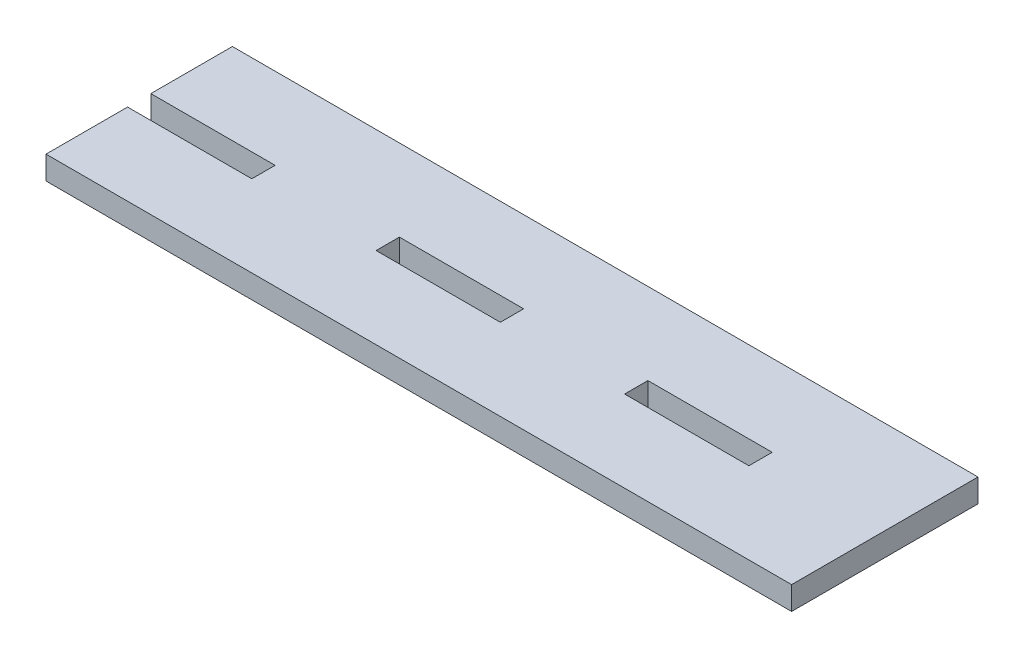
ISO-10303-21;
HEADER;
FILE_DESCRIPTION(('STEP AP214'),'2;1');
FILE_NAME('part.step','',(''),(''),'','','');
FILE_SCHEMA(('AUTOMOTIVE_DESIGN { 1 0 10303 214 1 1 1 1 }'));
ENDSEC;
DATA;
#1=APPLICATION_CONTEXT('core data for automotive mechanical design processes');
#2=APPLICATION_PROTOCOL_DEFINITION('international standard','automotive_design',2000,#1);
#3=PRODUCT_CONTEXT('',#1,'mechanical');
#4=PRODUCT('Part','Part','',(#3));
#5=PRODUCT_RELATED_PRODUCT_CATEGORY('part','',(#4));
#6=PRODUCT_DEFINITION_FORMATION('','',#4);
#7=PRODUCT_DEFINITION_CONTEXT('part definition',#1,'design');
#8=PRODUCT_DEFINITION('design','',#6,#7);
#9=PRODUCT_DEFINITION_SHAPE('','',#8);
#10=(LENGTH_UNIT() NAMED_UNIT(*) SI_UNIT(.MILLI.,.METRE.));
#11=(NAMED_UNIT(*) PLANE_ANGLE_UNIT() SI_UNIT($,.RADIAN.));
#12=(NAMED_UNIT(*) SI_UNIT($,.STERADIAN.) SOLID_ANGLE_UNIT());
#13=UNCERTAINTY_MEASURE_WITH_UNIT(LENGTH_MEASURE(1.E-05),#10,'distance_accuracy_value','');
#14=(GEOMETRIC_REPRESENTATION_CONTEXT(3) GLOBAL_UNCERTAINTY_ASSIGNED_CONTEXT((#13)) GLOBAL_UNIT_ASSIGNED_CONTEXT((#10,
#11,#12)) REPRESENTATION_CONTEXT('',''));
#15=CARTESIAN_POINT('',(0.,0.,0.));
#16=DIRECTION('',(0.,0.,1.));
#17=DIRECTION('',(1.,0.,0.));
#18=AXIS2_PLACEMENT_3D('',#15,#16,#17);
#19=CARTESIAN_POINT('',(25.4,4.7625,0.));
#20=DIRECTION('',(-1.,0.,0.));
#21=DIRECTION('',(0.,0.,1.));
#22=AXIS2_PLACEMENT_3D('',#19,#20,#21);
#23=PLANE('',#22);
#24=DIRECTION('',(0.,0.,-1.));
#25=VECTOR('',#24,1.);
#26=CARTESIAN_POINT('',(25.4,0.,0.));
#27=LINE('',#26,#25);
#28=CARTESIAN_POINT('',(25.4,0.,2.38125));
#29=VERTEX_POINT('',#28);
#30=CARTESIAN_POINT('',(25.4,0.,-2.38125));
#31=VERTEX_POINT('',#30);
#32=EDGE_CURVE('E218',#29,#31,#27,.T.);
#33=ORIENTED_EDGE('',*,*,#32,.T.);
#34=DIRECTION('',(0.,-1.,0.));
#35=VECTOR('',#34,1.);
#36=CARTESIAN_POINT('',(25.4,4.7625,-2.38125));
#37=LINE('',#36,#35);
#38=CARTESIAN_POINT('',(25.4,4.7625,-2.38125));
#39=VERTEX_POINT('',#38);
#40=EDGE_CURVE('E11',#39,#31,#37,.T.);
#41=ORIENTED_EDGE('',*,*,#40,.F.);
#42=DIRECTION('',(0.,0.,-1.));
#43=VECTOR('',#42,1.);
#44=CARTESIAN_POINT('',(25.4,4.7625,0.));
#45=LINE('',#44,#43);
#46=CARTESIAN_POINT('',(25.4,4.7625,2.38125));
#47=VERTEX_POINT('',#46);
#48=EDGE_CURVE('E168',#47,#39,#45,.T.);
#49=ORIENTED_EDGE('',*,*,#48,.F.);
#50=DIRECTION('',(0.,-1.,0.));
#51=VECTOR('',#50,1.);
#52=CARTESIAN_POINT('',(25.4,4.7625,2.38125));
#53=LINE('',#52,#51);
#54=EDGE_CURVE('E60',#47,#29,#53,.T.);
#55=ORIENTED_EDGE('',*,*,#54,.T.);
#56=EDGE_LOOP('',(#33,#41,#49,#55));
#57=FACE_BOUND('',#56,.T.);
#58=ADVANCED_FACE('F41',(#57),#23,.F.);
#59=CARTESIAN_POINT('',(0.,4.7625,-2.38124999999999));
#60=DIRECTION('',(0.,0.,-1.));
#61=DIRECTION('',(-1.,0.,0.));
#62=AXIS2_PLACEMENT_3D('',#59,#60,#61);
#63=PLANE('',#62);
#64=DIRECTION('',(1.,0.,0.));
#65=VECTOR('',#64,1.);
#66=CARTESIAN_POINT('',(0.,0.,-2.38124999999999));
#67=LINE('',#66,#65);
#68=CARTESIAN_POINT('',(50.8,0.,-2.38125000000001));
#69=VERTEX_POINT('',#68);
#70=EDGE_CURVE('E174',#31,#69,#67,.T.);
#71=ORIENTED_EDGE('',*,*,#70,.T.);
#72=DIRECTION('',(0.,-1.,0.));
#73=VECTOR('',#72,1.);
#74=CARTESIAN_POINT('',(50.8,4.7625,-2.38125000000001));
#75=LINE('',#74,#73);
#76=CARTESIAN_POINT('',(50.8,4.7625,-2.38125000000001));
#77=VERTEX_POINT('',#76);
#78=EDGE_CURVE('E51',#77,#69,#75,.T.);
#79=ORIENTED_EDGE('',*,*,#78,.F.);
#80=DIRECTION('',(1.,0.,0.));
#81=VECTOR('',#80,1.);
#82=CARTESIAN_POINT('',(0.,4.7625,-2.38124999999999));
#83=LINE('',#82,#81);
#84=EDGE_CURVE('E162',#39,#77,#83,.T.);
#85=ORIENTED_EDGE('',*,*,#84,.F.);
#86=ORIENTED_EDGE('',*,*,#40,.T.);
#87=EDGE_LOOP('',(#71,#79,#85,#86));
#88=FACE_BOUND('',#87,.T.);
#89=ADVANCED_FACE('F173',(#88),#63,.F.);
#90=CARTESIAN_POINT('',(50.8,4.7625,0.));
#91=DIRECTION('',(-1.,0.,0.));
#92=DIRECTION('',(0.,0.,1.));
#93=AXIS2_PLACEMENT_3D('',#90,#91,#92);
#94=PLANE('',#93);
#95=DIRECTION('',(0.,0.,-1.));
#96=VECTOR('',#95,1.);
#97=CARTESIAN_POINT('',(50.8,0.,0.));
#98=LINE('',#97,#96);
#99=CARTESIAN_POINT('',(50.8,0.,2.38125));
#100=VERTEX_POINT('',#99);
#101=EDGE_CURVE('E221',#100,#69,#98,.T.);
#102=ORIENTED_EDGE('',*,*,#101,.F.);
#103=DIRECTION('',(0.,-1.,0.));
#104=VECTOR('',#103,1.);
#105=CARTESIAN_POINT('',(50.8,4.7625,2.38125));
#106=LINE('',#105,#104);
#107=CARTESIAN_POINT('',(50.8,4.7625,2.38125));
#108=VERTEX_POINT('',#107);
#109=EDGE_CURVE('E110',#108,#100,#106,.T.);
#110=ORIENTED_EDGE('',*,*,#109,.F.);
#111=DIRECTION('',(0.,0.,-1.));
#112=VECTOR('',#111,1.);
#113=CARTESIAN_POINT('',(50.8,4.7625,0.));
#114=LINE('',#113,#112);
#115=EDGE_CURVE('E167',#108,#77,#114,.T.);
#116=ORIENTED_EDGE('',*,*,#115,.T.);
#117=ORIENTED_EDGE('',*,*,#78,.T.);
#118=EDGE_LOOP('',(#102,#110,#116,#117));
#119=FACE_BOUND('',#118,.T.);
#120=ADVANCED_FACE('F178',(#119),#94,.T.);
#121=CARTESIAN_POINT('',(-25.3999999999999,4.7625,0.));
#122=DIRECTION('',(-1.,0.,0.));
#123=DIRECTION('',(0.,0.,1.));
#124=AXIS2_PLACEMENT_3D('',#121,#122,#123);
#125=PLANE('',#124);
#126=DIRECTION('',(0.,0.,-1.));
#127=VECTOR('',#126,1.);
#128=CARTESIAN_POINT('',(-25.3999999999999,0.,0.));
#129=LINE('',#128,#127);
#130=CARTESIAN_POINT('',(-25.3999999999999,0.,2.38125));
#131=VERTEX_POINT('',#130);
#132=CARTESIAN_POINT('',(-25.3999999999999,0.,-2.38125));
#133=VERTEX_POINT('',#132);
#134=EDGE_CURVE('E206',#131,#133,#129,.T.);
#135=ORIENTED_EDGE('',*,*,#134,.T.);
#136=DIRECTION('',(0.,-1.,0.));
#137=VECTOR('',#136,1.);
#138=CARTESIAN_POINT('',(-25.3999999999999,4.7625,-2.38125));
#139=LINE('',#138,#137);
#140=CARTESIAN_POINT('',(-25.3999999999999,4.7625,-2.38125));
#141=VERTEX_POINT('',#140);
#142=EDGE_CURVE('E228',#141,#133,#139,.T.);
#143=ORIENTED_EDGE('',*,*,#142,.F.);
#144=DIRECTION('',(0.,0.,-1.));
#145=VECTOR('',#144,1.);
#146=CARTESIAN_POINT('',(-25.3999999999999,4.7625,0.));
#147=LINE('',#146,#145);
#148=CARTESIAN_POINT('',(-25.3999999999999,4.7625,2.38125));
#149=VERTEX_POINT('',#148);
#150=EDGE_CURVE('E287',#149,#141,#147,.T.);
#151=ORIENTED_EDGE('',*,*,#150,.F.);
#152=DIRECTION('',(0.,-1.,0.));
#153=VECTOR('',#152,1.);
#154=CARTESIAN_POINT('',(-25.3999999999999,4.7625,2.38125));
#155=LINE('',#154,#153);
#156=EDGE_CURVE('E230',#149,#131,#155,.T.);
#157=ORIENTED_EDGE('',*,*,#156,.T.);
#158=EDGE_LOOP('',(#135,#143,#151,#157));
#159=FACE_BOUND('',#158,.T.);
#160=ADVANCED_FACE('F318',(#159),#125,.F.);
#161=CARTESIAN_POINT('',(0.,4.7625,-2.38125000000001));
#162=DIRECTION('',(0.,0.,-1.));
#163=DIRECTION('',(-1.,0.,0.));
#164=AXIS2_PLACEMENT_3D('',#161,#162,#163);
#165=PLANE('',#164);
#166=DIRECTION('',(1.,0.,0.));
#167=VECTOR('',#166,1.);
#168=CARTESIAN_POINT('',(0.,0.,-2.38125000000001));
#169=LINE('',#168,#167);
#170=CARTESIAN_POINT('',(0.,0.,-2.38125000000001));
#171=VERTEX_POINT('',#170);
#172=EDGE_CURVE('E209',#133,#171,#169,.T.);
#173=ORIENTED_EDGE('',*,*,#172,.T.);
#174=DIRECTION('',(0.,-1.,0.));
#175=VECTOR('',#174,1.);
#176=CARTESIAN_POINT('',(0.,4.7625,-2.38125000000001));
#177=LINE('',#176,#175);
#178=CARTESIAN_POINT('',(0.,4.7625,-2.38125000000001));
#179=VERTEX_POINT('',#178);
#180=EDGE_CURVE('E234',#179,#171,#177,.T.);
#181=ORIENTED_EDGE('',*,*,#180,.F.);
#182=DIRECTION('',(1.,0.,0.));
#183=VECTOR('',#182,1.);
#184=CARTESIAN_POINT('',(0.,4.7625,-2.38125000000001));
#185=LINE('',#184,#183);
#186=EDGE_CURVE('E297',#141,#179,#185,.T.);
#187=ORIENTED_EDGE('',*,*,#186,.F.);
#188=ORIENTED_EDGE('',*,*,#142,.T.);
#189=EDGE_LOOP('',(#173,#181,#187,#188));
#190=FACE_BOUND('',#189,.T.);
#191=ADVANCED_FACE('F320',(#190),#165,.F.);
#192=CARTESIAN_POINT('',(0.,4.7625,0.));
#193=DIRECTION('',(-1.,0.,0.));
#194=DIRECTION('',(0.,0.,1.));
#195=AXIS2_PLACEMENT_3D('',#192,#193,#194);
#196=PLANE('',#195);
#197=DIRECTION('',(0.,0.,-1.));
#198=VECTOR('',#197,1.);
#199=CARTESIAN_POINT('',(0.,0.,0.));
#200=LINE('',#199,#198);
#201=CARTESIAN_POINT('',(0.,0.,2.38125));
#202=VERTEX_POINT('',#201);
#203=EDGE_CURVE('E212',#202,#171,#200,.T.);
#204=ORIENTED_EDGE('',*,*,#203,.F.);
#205=DIRECTION('',(0.,-1.,0.));
#206=VECTOR('',#205,1.);
#207=CARTESIAN_POINT('',(0.,4.7625,2.38125));
#208=LINE('',#207,#206);
#209=CARTESIAN_POINT('',(0.,4.7625,2.38125));
#210=VERTEX_POINT('',#209);
#211=EDGE_CURVE('E232',#210,#202,#208,.T.);
#212=ORIENTED_EDGE('',*,*,#211,.F.);
#213=DIRECTION('',(0.,0.,-1.));
#214=VECTOR('',#213,1.);
#215=CARTESIAN_POINT('',(0.,4.7625,0.));
#216=LINE('',#215,#214);
#217=EDGE_CURVE('E299',#210,#179,#216,.T.);
#218=ORIENTED_EDGE('',*,*,#217,.T.);
#219=ORIENTED_EDGE('',*,*,#180,.T.);
#220=EDGE_LOOP('',(#204,#212,#218,#219));
#221=FACE_BOUND('',#220,.T.);
#222=ADVANCED_FACE('F314',(#221),#196,.T.);
#223=CARTESIAN_POINT('',(-50.7999999999999,4.7625,0.));
#224=DIRECTION('',(-1.,0.,0.));
#225=DIRECTION('',(0.,0.,1.));
#226=AXIS2_PLACEMENT_3D('',#223,#224,#225);
#227=PLANE('',#226);
#228=DIRECTION('',(0.,0.,-1.));
#229=VECTOR('',#228,1.);
#230=CARTESIAN_POINT('',(-50.7999999999999,0.,0.));
#231=LINE('',#230,#229);
#232=CARTESIAN_POINT('',(-50.7999999999999,0.,2.38125));
#233=VERTEX_POINT('',#232);
#234=CARTESIAN_POINT('',(-50.7999999999999,0.,-2.38125000000001));
#235=VERTEX_POINT('',#234);
#236=EDGE_CURVE('E185',#233,#235,#231,.T.);
#237=ORIENTED_EDGE('',*,*,#236,.F.);
#238=DIRECTION('',(0.,-1.,0.));
#239=VECTOR('',#238,1.);
#240=CARTESIAN_POINT('',(-50.7999999999999,4.7625,2.38125));
#241=LINE('',#240,#239);
#242=CARTESIAN_POINT('',(-50.7999999999999,4.7625,2.38125));
#243=VERTEX_POINT('',#242);
#244=EDGE_CURVE('E45',#243,#233,#241,.T.);
#245=ORIENTED_EDGE('',*,*,#244,.F.);
#246=DIRECTION('',(0.,0.,-1.));
#247=VECTOR('',#246,1.);
#248=CARTESIAN_POINT('',(-50.7999999999999,4.7625,0.));
#249=LINE('',#248,#247);
#250=CARTESIAN_POINT('',(-50.7999999999999,4.7625,-2.38125000000001));
#251=VERTEX_POINT('',#250);
#252=EDGE_CURVE('E226',#243,#251,#249,.T.);
#253=ORIENTED_EDGE('',*,*,#252,.T.);
#254=DIRECTION('',(0.,-1.,0.));
#255=VECTOR('',#254,1.);
#256=CARTESIAN_POINT('',(-50.7999999999999,4.7625,-2.38125000000001));
#257=LINE('',#256,#255);
#258=EDGE_CURVE('E181',#251,#235,#257,.T.);
#259=ORIENTED_EDGE('',*,*,#258,.T.);
#260=EDGE_LOOP('',(#237,#245,#253,#259));
#261=FACE_BOUND('',#260,.T.);
#262=ADVANCED_FACE('F43',(#261),#227,.T.);
#263=CARTESIAN_POINT('',(0.,4.7625,2.38125));
#264=DIRECTION('',(0.,0.,-1.));
#265=DIRECTION('',(-1.,0.,0.));
#266=AXIS2_PLACEMENT_3D('',#263,#264,#265);
#267=PLANE('',#266);
#268=DIRECTION('',(1.,0.,0.));
#269=VECTOR('',#268,1.);
#270=CARTESIAN_POINT('',(0.,0.,2.38125));
#271=LINE('',#270,#269);
#272=CARTESIAN_POINT('',(-76.1999999999999,0.,2.38125));
#273=VERTEX_POINT('',#272);
#274=EDGE_CURVE('E188',#273,#233,#271,.T.);
#275=ORIENTED_EDGE('',*,*,#274,.F.);
#276=DIRECTION('',(0.,-1.,0.));
#277=VECTOR('',#276,1.);
#278=CARTESIAN_POINT('',(-76.1999999999999,4.7625,2.38125));
#279=LINE('',#278,#277);
#280=CARTESIAN_POINT('',(-76.1999999999999,4.7625,2.38125));
#281=VERTEX_POINT('',#280);
#282=EDGE_CURVE('E249',#281,#273,#279,.T.);
#283=ORIENTED_EDGE('',*,*,#282,.F.);
#284=DIRECTION('',(1.,0.,0.));
#285=VECTOR('',#284,1.);
#286=CARTESIAN_POINT('',(0.,4.7625,2.38125));
#287=LINE('',#286,#285);
#288=EDGE_CURVE('E258',#281,#243,#287,.T.);
#289=ORIENTED_EDGE('',*,*,#288,.T.);
#290=ORIENTED_EDGE('',*,*,#244,.T.);
#291=EDGE_LOOP('',(#275,#283,#289,#290));
#292=FACE_BOUND('',#291,.T.);
#293=ADVANCED_FACE('F256',(#292),#267,.T.);
#294=CARTESIAN_POINT('',(-76.1999999999999,4.7625,0.));
#295=DIRECTION('',(-1.,0.,0.));
#296=DIRECTION('',(0.,0.,1.));
#297=AXIS2_PLACEMENT_3D('',#294,#295,#296);
#298=PLANE('',#297);
#299=DIRECTION('',(0.,0.,-1.));
#300=VECTOR('',#299,1.);
#301=CARTESIAN_POINT('',(-76.1999999999999,0.,0.));
#302=LINE('',#301,#300);
#303=CARTESIAN_POINT('',(-76.1999999999999,0.,19.05));
#304=VERTEX_POINT('',#303);
#305=EDGE_CURVE('E191',#304,#273,#302,.T.);
#306=ORIENTED_EDGE('',*,*,#305,.F.);
#307=DIRECTION('',(0.,-1.,0.));
#308=VECTOR('',#307,1.);
#309=CARTESIAN_POINT('',(-76.1999999999999,4.7625,19.05));
#310=LINE('',#309,#308);
#311=CARTESIAN_POINT('',(-76.1999999999999,4.7625,19.05));
#312=VERTEX_POINT('',#311);
#313=EDGE_CURVE('E248',#312,#304,#310,.T.);
#314=ORIENTED_EDGE('',*,*,#313,.F.);
#315=DIRECTION('',(0.,0.,-1.));
#316=VECTOR('',#315,1.);
#317=CARTESIAN_POINT('',(-76.1999999999999,4.7625,0.));
#318=LINE('',#317,#316);
#319=EDGE_CURVE('E269',#312,#281,#318,.T.);
#320=ORIENTED_EDGE('',*,*,#319,.T.);
#321=ORIENTED_EDGE('',*,*,#282,.T.);
#322=EDGE_LOOP('',(#306,#314,#320,#321));
#323=FACE_BOUND('',#322,.T.);
#324=ADVANCED_FACE('F266',(#323),#298,.T.);
#325=CARTESIAN_POINT('',(0.,4.7625,19.05));
#326=DIRECTION('',(0.,0.,-1.));
#327=DIRECTION('',(-1.,0.,0.));
#328=AXIS2_PLACEMENT_3D('',#325,#326,#327);
#329=PLANE('',#328);
#330=DIRECTION('',(1.,0.,0.));
#331=VECTOR('',#330,1.);
#332=CARTESIAN_POINT('',(0.,0.,19.05));
#333=LINE('',#332,#331);
#334=CARTESIAN_POINT('',(76.2000000000001,0.,19.05));
#335=VERTEX_POINT('',#334);
#336=EDGE_CURVE('E194',#304,#335,#333,.T.);
#337=ORIENTED_EDGE('',*,*,#336,.T.);
#338=DIRECTION('',(0.,-1.,0.));
#339=VECTOR('',#338,1.);
#340=CARTESIAN_POINT('',(76.2000000000001,4.7625,19.05));
#341=LINE('',#340,#339);
#342=CARTESIAN_POINT('',(76.2000000000001,4.7625,19.05));
#343=VERTEX_POINT('',#342);
#344=EDGE_CURVE('E245',#343,#335,#341,.T.);
#345=ORIENTED_EDGE('',*,*,#344,.F.);
#346=DIRECTION('',(1.,0.,0.));
#347=VECTOR('',#346,1.);
#348=CARTESIAN_POINT('',(0.,4.7625,19.05));
#349=LINE('',#348,#347);
#350=EDGE_CURVE('E272',#312,#343,#349,.T.);
#351=ORIENTED_EDGE('',*,*,#350,.F.);
#352=ORIENTED_EDGE('',*,*,#313,.T.);
#353=EDGE_LOOP('',(#337,#345,#351,#352));
#354=FACE_BOUND('',#353,.T.);
#355=ADVANCED_FACE('F273',(#354),#329,.F.);
#356=CARTESIAN_POINT('',(76.2000000000001,4.7625,0.));
#357=DIRECTION('',(-1.,0.,0.));
#358=DIRECTION('',(0.,0.,1.));
#359=AXIS2_PLACEMENT_3D('',#356,#357,#358);
#360=PLANE('',#359);
#361=DIRECTION('',(0.,0.,-1.));
#362=VECTOR('',#361,1.);
#363=CARTESIAN_POINT('',(76.2000000000001,0.,0.));
#364=LINE('',#363,#362);
#365=CARTESIAN_POINT('',(76.2000000000001,0.,-19.05));
#366=VERTEX_POINT('',#365);
#367=EDGE_CURVE('E197',#335,#366,#364,.T.);
#368=ORIENTED_EDGE('',*,*,#367,.T.);
#369=DIRECTION('',(0.,-1.,0.));
#370=VECTOR('',#369,1.);
#371=CARTESIAN_POINT('',(76.2000000000001,4.7625,-19.05));
#372=LINE('',#371,#370);
#373=CARTESIAN_POINT('',(76.2000000000001,4.7625,-19.05));
#374=VERTEX_POINT('',#373);
#375=EDGE_CURVE('E243',#374,#366,#372,.T.);
#376=ORIENTED_EDGE('',*,*,#375,.F.);
#377=DIRECTION('',(0.,0.,-1.));
#378=VECTOR('',#377,1.);
#379=CARTESIAN_POINT('',(76.2000000000001,4.7625,0.));
#380=LINE('',#379,#378);
#381=EDGE_CURVE('E276',#343,#374,#380,.T.);
#382=ORIENTED_EDGE('',*,*,#381,.F.);
#383=ORIENTED_EDGE('',*,*,#344,.T.);
#384=EDGE_LOOP('',(#368,#376,#382,#383));
#385=FACE_BOUND('',#384,.T.);
#386=ADVANCED_FACE('F352',(#385),#360,.F.);
#387=CARTESIAN_POINT('',(0.,4.7625,-19.05));
#388=DIRECTION('',(0.,0.,-1.));
#389=DIRECTION('',(-1.,0.,0.));
#390=AXIS2_PLACEMENT_3D('',#387,#388,#389);
#391=PLANE('',#390);
#392=DIRECTION('',(1.,0.,0.));
#393=VECTOR('',#392,1.);
#394=CARTESIAN_POINT('',(0.,0.,-19.05));
#395=LINE('',#394,#393);
#396=CARTESIAN_POINT('',(-76.1999999999999,0.,-19.05));
#397=VERTEX_POINT('',#396);
#398=EDGE_CURVE('E200',#397,#366,#395,.T.);
#399=ORIENTED_EDGE('',*,*,#398,.F.);
#400=DIRECTION('',(0.,-1.,0.));
#401=VECTOR('',#400,1.);
#402=CARTESIAN_POINT('',(-76.1999999999999,4.7625,-19.05));
#403=LINE('',#402,#401);
#404=CARTESIAN_POINT('',(-76.1999999999999,4.7625,-19.05));
#405=VERTEX_POINT('',#404);
#406=EDGE_CURVE('E241',#405,#397,#403,.T.);
#407=ORIENTED_EDGE('',*,*,#406,.F.);
#408=DIRECTION('',(1.,0.,0.));
#409=VECTOR('',#408,1.);
#410=CARTESIAN_POINT('',(0.,4.7625,-19.05));
#411=LINE('',#410,#409);
#412=EDGE_CURVE('E284',#405,#374,#411,.T.);
#413=ORIENTED_EDGE('',*,*,#412,.T.);
#414=ORIENTED_EDGE('',*,*,#375,.T.);
#415=EDGE_LOOP('',(#399,#407,#413,#414));
#416=FACE_BOUND('',#415,.T.);
#417=ADVANCED_FACE('F347',(#416),#391,.T.);
#418=CARTESIAN_POINT('',(-76.1999999999999,0.,-2.38125));
#419=VERTEX_POINT('',#418);
#420=EDGE_CURVE('E195',#419,#397,#302,.T.);
#421=ORIENTED_EDGE('',*,*,#420,.F.);
#422=DIRECTION('',(0.,-1.,0.));
#423=VECTOR('',#422,1.);
#424=CARTESIAN_POINT('',(-76.1999999999999,4.7625,-2.38125));
#425=LINE('',#424,#423);
#426=CARTESIAN_POINT('',(-76.1999999999999,4.7625,-2.38125));
#427=VERTEX_POINT('',#426);
#428=EDGE_CURVE('E239',#427,#419,#425,.T.);
#429=ORIENTED_EDGE('',*,*,#428,.F.);
#430=EDGE_CURVE('E280',#427,#405,#318,.T.);
#431=ORIENTED_EDGE('',*,*,#430,.T.);
#432=ORIENTED_EDGE('',*,*,#406,.T.);
#433=EDGE_LOOP('',(#421,#429,#431,#432));
#434=FACE_BOUND('',#433,.T.);
#435=ADVANCED_FACE('F339',(#434),#298,.T.);
#436=CARTESIAN_POINT('',(0.,4.7625,2.38125));
#437=DIRECTION('',(0.,0.,-1.));
#438=DIRECTION('',(-1.,0.,0.));
#439=AXIS2_PLACEMENT_3D('',#436,#437,#438);
#440=PLANE('',#439);
#441=DIRECTION('',(1.,0.,0.));
#442=VECTOR('',#441,1.);
#443=CARTESIAN_POINT('',(0.,0.,2.38125));
#444=LINE('',#443,#442);
#445=EDGE_CURVE('E215',#131,#202,#444,.T.);
#446=ORIENTED_EDGE('',*,*,#445,.F.);
#447=ORIENTED_EDGE('',*,*,#156,.F.);
#448=DIRECTION('',(1.,0.,0.));
#449=VECTOR('',#448,1.);
#450=CARTESIAN_POINT('',(0.,4.7625,2.38125));
#451=LINE('',#450,#449);
#452=EDGE_CURVE('E302',#149,#210,#451,.T.);
#453=ORIENTED_EDGE('',*,*,#452,.T.);
#454=ORIENTED_EDGE('',*,*,#211,.T.);
#455=EDGE_LOOP('',(#446,#447,#453,#454));
#456=FACE_BOUND('',#455,.T.);
#457=ADVANCED_FACE('F307',(#456),#440,.T.);
#458=CARTESIAN_POINT('',(0.,4.7625,-2.38125000000002));
#459=DIRECTION('',(0.,0.,-1.));
#460=DIRECTION('',(-1.,0.,0.));
#461=AXIS2_PLACEMENT_3D('',#458,#459,#460);
#462=PLANE('',#461);
#463=DIRECTION('',(1.,0.,0.));
#464=VECTOR('',#463,1.);
#465=CARTESIAN_POINT('',(0.,0.,-2.38125000000002));
#466=LINE('',#465,#464);
#467=EDGE_CURVE('E203',#419,#235,#466,.T.);
#468=ORIENTED_EDGE('',*,*,#467,.T.);
#469=ORIENTED_EDGE('',*,*,#258,.F.);
#470=DIRECTION('',(1.,0.,0.));
#471=VECTOR('',#470,1.);
#472=CARTESIAN_POINT('',(0.,4.7625,-2.38125000000002));
#473=LINE('',#472,#471);
#474=EDGE_CURVE('E283',#427,#251,#473,.T.);
#475=ORIENTED_EDGE('',*,*,#474,.F.);
#476=ORIENTED_EDGE('',*,*,#428,.T.);
#477=EDGE_LOOP('',(#468,#469,#475,#476));
#478=FACE_BOUND('',#477,.T.);
#479=ADVANCED_FACE('F338',(#478),#462,.F.);
#480=CARTESIAN_POINT('',(0.,4.7625,2.38125));
#481=DIRECTION('',(0.,0.,-1.));
#482=DIRECTION('',(-1.,0.,0.));
#483=AXIS2_PLACEMENT_3D('',#480,#481,#482);
#484=PLANE('',#483);
#485=DIRECTION('',(1.,0.,0.));
#486=VECTOR('',#485,1.);
#487=CARTESIAN_POINT('',(0.,0.,2.38125));
#488=LINE('',#487,#486);
#489=EDGE_CURVE('E223',#29,#100,#488,.T.);
#490=ORIENTED_EDGE('',*,*,#489,.F.);
#491=ORIENTED_EDGE('',*,*,#54,.F.);
#492=DIRECTION('',(1.,0.,0.));
#493=VECTOR('',#492,1.);
#494=CARTESIAN_POINT('',(0.,4.7625,2.38125));
#495=LINE('',#494,#493);
#496=EDGE_CURVE('E179',#47,#108,#495,.T.);
#497=ORIENTED_EDGE('',*,*,#496,.T.);
#498=ORIENTED_EDGE('',*,*,#109,.T.);
#499=EDGE_LOOP('',(#490,#491,#497,#498));
#500=FACE_BOUND('',#499,.T.);
#501=ADVANCED_FACE('F344',(#500),#484,.T.);
#502=CARTESIAN_POINT('',(0.,4.7625,0.));
#503=DIRECTION('',(0.,1.,0.));
#504=DIRECTION('',(0.,0.,1.));
#505=AXIS2_PLACEMENT_3D('',#502,#503,#504);
#506=PLANE('',#505);
#507=ORIENTED_EDGE('',*,*,#252,.F.);
#508=ORIENTED_EDGE('',*,*,#288,.F.);
#509=ORIENTED_EDGE('',*,*,#319,.F.);
#510=ORIENTED_EDGE('',*,*,#350,.T.);
#511=ORIENTED_EDGE('',*,*,#381,.T.);
#512=ORIENTED_EDGE('',*,*,#412,.F.);
#513=ORIENTED_EDGE('',*,*,#430,.F.);
#514=ORIENTED_EDGE('',*,*,#474,.T.);
#515=EDGE_LOOP('',(#507,#508,#509,#510,#511,#512,#513,#514));
#516=FACE_BOUND('',#515,.T.);
#517=ORIENTED_EDGE('',*,*,#150,.T.);
#518=ORIENTED_EDGE('',*,*,#186,.T.);
#519=ORIENTED_EDGE('',*,*,#217,.F.);
#520=ORIENTED_EDGE('',*,*,#452,.F.);
#521=EDGE_LOOP('',(#517,#518,#519,#520));
#522=FACE_BOUND('',#521,.T.);
#523=ORIENTED_EDGE('',*,*,#48,.T.);
#524=ORIENTED_EDGE('',*,*,#84,.T.);
#525=ORIENTED_EDGE('',*,*,#115,.F.);
#526=ORIENTED_EDGE('',*,*,#496,.F.);
#527=EDGE_LOOP('',(#523,#524,#525,#526));
#528=FACE_BOUND('',#527,.T.);
#529=ADVANCED_FACE('F164',(#516,#522,#528),#506,.T.);
#530=CARTESIAN_POINT('',(0.,0.,0.));
#531=DIRECTION('',(0.,1.,0.));
#532=DIRECTION('',(0.,0.,1.));
#533=AXIS2_PLACEMENT_3D('',#530,#531,#532);
#534=PLANE('',#533);
#535=ORIENTED_EDGE('',*,*,#236,.T.);
#536=ORIENTED_EDGE('',*,*,#467,.F.);
#537=ORIENTED_EDGE('',*,*,#420,.T.);
#538=ORIENTED_EDGE('',*,*,#398,.T.);
#539=ORIENTED_EDGE('',*,*,#367,.F.);
#540=ORIENTED_EDGE('',*,*,#336,.F.);
#541=ORIENTED_EDGE('',*,*,#305,.T.);
#542=ORIENTED_EDGE('',*,*,#274,.T.);
#543=EDGE_LOOP('',(#535,#536,#537,#538,#539,#540,#541,#542));
#544=FACE_BOUND('',#543,.T.);
#545=ORIENTED_EDGE('',*,*,#134,.F.);
#546=ORIENTED_EDGE('',*,*,#445,.T.);
#547=ORIENTED_EDGE('',*,*,#203,.T.);
#548=ORIENTED_EDGE('',*,*,#172,.F.);
#549=EDGE_LOOP('',(#545,#546,#547,#548));
#550=FACE_BOUND('',#549,.T.);
#551=ORIENTED_EDGE('',*,*,#32,.F.);
#552=ORIENTED_EDGE('',*,*,#489,.T.);
#553=ORIENTED_EDGE('',*,*,#101,.T.);
#554=ORIENTED_EDGE('',*,*,#70,.F.);
#555=EDGE_LOOP('',(#551,#552,#553,#554));
#556=FACE_BOUND('',#555,.T.);
#557=ADVANCED_FACE('F262',(#544,#550,#556),#534,.F.);
#558=CLOSED_SHELL('',(#58,#89,#120,#160,#191,#222,#262,#293,#324,#355,#386,#417,#435,#457,#479,
#501,#529,#557));
#559=MANIFOLD_SOLID_BREP('B2',#558);
#560=ADVANCED_BREP_SHAPE_REPRESENTATION('',(#18,#559),#14);
#561=SHAPE_DEFINITION_REPRESENTATION(#9,#560);
ENDSEC;
END-ISO-10303-21;
